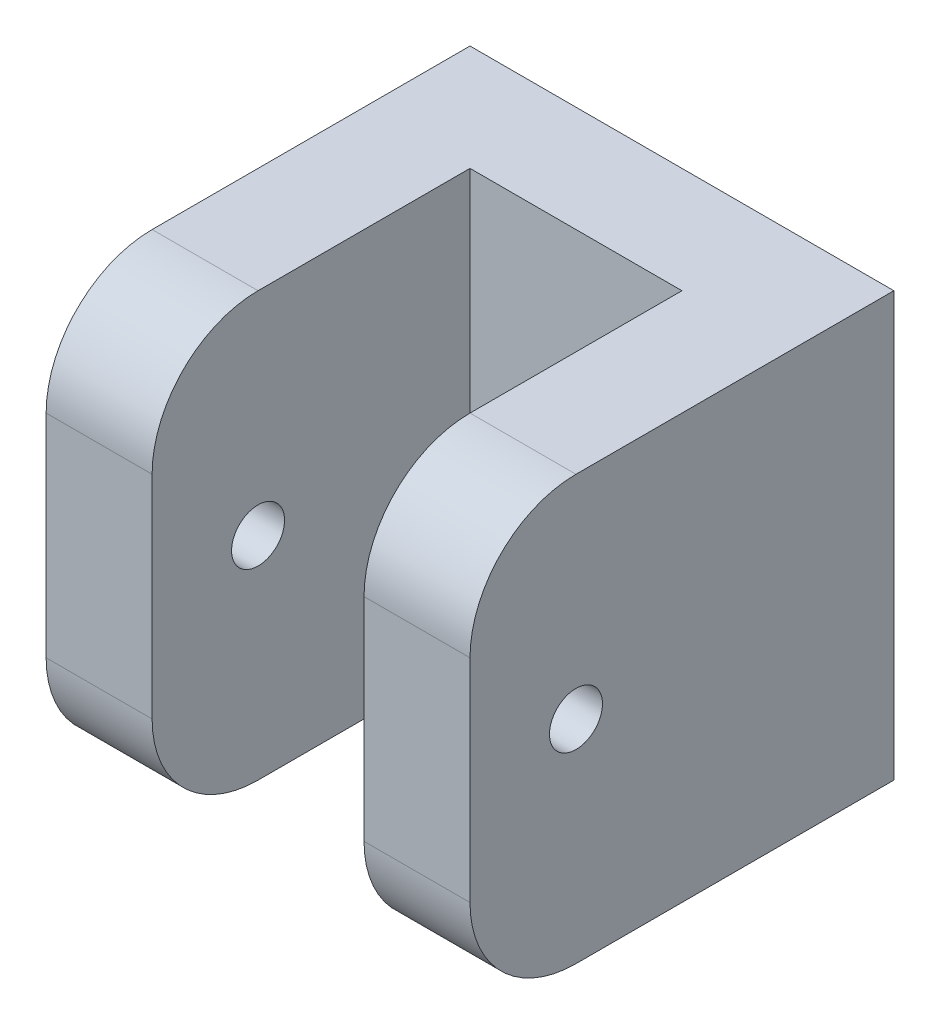
ISO-10303-21;
HEADER;
FILE_DESCRIPTION(('STEP AP214'),'2;1');
FILE_NAME('part.step','',(''),(''),'','','');
FILE_SCHEMA(('AUTOMOTIVE_DESIGN { 1 0 10303 214 1 1 1 1 }'));
ENDSEC;
DATA;
#1=APPLICATION_CONTEXT('core data for automotive mechanical design processes');
#2=APPLICATION_PROTOCOL_DEFINITION('international standard','automotive_design',2000,#1);
#3=PRODUCT_CONTEXT('',#1,'mechanical');
#4=PRODUCT('Part','Part','',(#3));
#5=PRODUCT_RELATED_PRODUCT_CATEGORY('part','',(#4));
#6=PRODUCT_DEFINITION_FORMATION('','',#4);
#7=PRODUCT_DEFINITION_CONTEXT('part definition',#1,'design');
#8=PRODUCT_DEFINITION('design','',#6,#7);
#9=PRODUCT_DEFINITION_SHAPE('','',#8);
#10=(LENGTH_UNIT() NAMED_UNIT(*) SI_UNIT(.MILLI.,.METRE.));
#11=(NAMED_UNIT(*) PLANE_ANGLE_UNIT() SI_UNIT($,.RADIAN.));
#12=(NAMED_UNIT(*) SI_UNIT($,.STERADIAN.) SOLID_ANGLE_UNIT());
#13=UNCERTAINTY_MEASURE_WITH_UNIT(LENGTH_MEASURE(1.E-05),#10,'distance_accuracy_value','');
#14=(GEOMETRIC_REPRESENTATION_CONTEXT(3) GLOBAL_UNCERTAINTY_ASSIGNED_CONTEXT((#13)) GLOBAL_UNIT_ASSIGNED_CONTEXT((#10,
#11,#12)) REPRESENTATION_CONTEXT('',''));
#15=CARTESIAN_POINT('',(0.,0.,0.));
#16=DIRECTION('',(0.,0.,1.));
#17=DIRECTION('',(1.,0.,0.));
#18=AXIS2_PLACEMENT_3D('',#15,#16,#17);
#19=CARTESIAN_POINT('',(25.3999999999999,50.8,25.3999999999999));
#20=DIRECTION('',(0.,0.,-1.));
#21=DIRECTION('',(-1.,0.,0.));
#22=AXIS2_PLACEMENT_3D('',#19,#20,#21);
#23=PLANE('',#22);
#24=DIRECTION('',(0.,-1.,0.));
#25=VECTOR('',#24,1.);
#26=CARTESIAN_POINT('',(-25.4,50.8,25.4));
#27=LINE('',#26,#25);
#28=CARTESIAN_POINT('',(-25.4,38.1,25.4));
#29=VERTEX_POINT('',#28);
#30=CARTESIAN_POINT('',(-25.4,12.7,25.4));
#31=VERTEX_POINT('',#30);
#32=EDGE_CURVE('E190',#29,#31,#27,.T.);
#33=ORIENTED_EDGE('',*,*,#32,.T.);
#34=DIRECTION('',(1.,0.,0.));
#35=VECTOR('',#34,1.);
#36=CARTESIAN_POINT('',(25.3999999999999,12.7,25.3999999999999));
#37=LINE('',#36,#35);
#38=CARTESIAN_POINT('',(-12.7,12.7,25.4));
#39=VERTEX_POINT('',#38);
#40=EDGE_CURVE('E200',#31,#39,#37,.T.);
#41=ORIENTED_EDGE('',*,*,#40,.T.);
#42=DIRECTION('',(0.,1.,0.));
#43=VECTOR('',#42,1.);
#44=CARTESIAN_POINT('',(-12.7,0.,25.4));
#45=LINE('',#44,#43);
#46=CARTESIAN_POINT('',(-12.7,38.1,25.4));
#47=VERTEX_POINT('',#46);
#48=EDGE_CURVE('E153',#39,#47,#45,.T.);
#49=ORIENTED_EDGE('',*,*,#48,.T.);
#50=DIRECTION('',(1.,0.,0.));
#51=VECTOR('',#50,1.);
#52=CARTESIAN_POINT('',(-25.4,38.1,25.4));
#53=LINE('',#52,#51);
#54=EDGE_CURVE('E193',#47,#29,#53,.F.);
#55=ORIENTED_EDGE('',*,*,#54,.T.);
#56=EDGE_LOOP('',(#33,#41,#49,#55));
#57=FACE_BOUND('',#56,.T.);
#58=ADVANCED_FACE('F37',(#57),#23,.F.);
#59=CARTESIAN_POINT('',(-25.4,50.8,25.4));
#60=DIRECTION('',(1.,0.,0.));
#61=DIRECTION('',(0.,0.,-1.));
#62=AXIS2_PLACEMENT_3D('',#59,#60,#61);
#63=PLANE('',#62);
#64=CARTESIAN_POINT('',(-25.4,25.4,12.6999999999999));
#65=DIRECTION('',(1.,0.,0.));
#66=DIRECTION('',(0.,0.,-1.));
#67=AXIS2_PLACEMENT_3D('',#64,#65,#66);
#68=CIRCLE('',#67,3.17499999999997);
#69=CARTESIAN_POINT('',(-25.4,25.4,9.5249999999999));
#70=VERTEX_POINT('',#69);
#71=EDGE_CURVE('E198',#70,#70,#68,.T.);
#72=ORIENTED_EDGE('',*,*,#71,.T.);
#73=EDGE_LOOP('',(#72));
#74=FACE_BOUND('',#73,.T.);
#75=DIRECTION('',(0.,0.,1.));
#76=VECTOR('',#75,1.);
#77=CARTESIAN_POINT('',(-25.4,0.,25.4));
#78=LINE('',#77,#76);
#79=CARTESIAN_POINT('',(-25.4,0.,-25.4));
#80=VERTEX_POINT('',#79);
#81=CARTESIAN_POINT('',(-25.4,0.,12.7));
#82=VERTEX_POINT('',#81);
#83=EDGE_CURVE('E139',#80,#82,#78,.T.);
#84=ORIENTED_EDGE('',*,*,#83,.T.);
#85=CARTESIAN_POINT('',(-25.4,12.7,12.7));
#86=DIRECTION('',(1.,0.,0.));
#87=DIRECTION('',(0.,0.,-1.));
#88=AXIS2_PLACEMENT_3D('',#85,#86,#87);
#89=CIRCLE('',#88,12.7);
#90=EDGE_CURVE('E212',#82,#31,#89,.F.);
#91=ORIENTED_EDGE('',*,*,#90,.T.);
#92=ORIENTED_EDGE('',*,*,#32,.F.);
#93=CARTESIAN_POINT('',(-25.4,38.1,12.7));
#94=DIRECTION('',(1.,0.,0.));
#95=DIRECTION('',(0.,0.,-1.));
#96=AXIS2_PLACEMENT_3D('',#93,#94,#95);
#97=CIRCLE('',#96,12.7);
#98=CARTESIAN_POINT('',(-25.4,50.8,12.7));
#99=VERTEX_POINT('',#98);
#100=EDGE_CURVE('E210',#29,#99,#97,.F.);
#101=ORIENTED_EDGE('',*,*,#100,.T.);
#102=DIRECTION('',(0.,0.,1.));
#103=VECTOR('',#102,1.);
#104=CARTESIAN_POINT('',(-25.4,50.8,25.4));
#105=LINE('',#104,#103);
#106=CARTESIAN_POINT('',(-25.4,50.8,-25.4));
#107=VERTEX_POINT('',#106);
#108=EDGE_CURVE('E168',#107,#99,#105,.T.);
#109=ORIENTED_EDGE('',*,*,#108,.F.);
#110=DIRECTION('',(0.,-1.,0.));
#111=VECTOR('',#110,1.);
#112=CARTESIAN_POINT('',(-25.4,50.8,-25.4));
#113=LINE('',#112,#111);
#114=EDGE_CURVE('E176',#107,#80,#113,.T.);
#115=ORIENTED_EDGE('',*,*,#114,.T.);
#116=EDGE_LOOP('',(#84,#91,#92,#101,#109,#115));
#117=FACE_BOUND('',#116,.T.);
#118=ADVANCED_FACE('F236',(#74,#117),#63,.F.);
#119=DIRECTION('',(0.,1.,0.));
#120=VECTOR('',#119,1.);
#121=CARTESIAN_POINT('',(12.6999999999999,0.,25.4));
#122=LINE('',#121,#120);
#123=CARTESIAN_POINT('',(12.6999999999999,12.7,25.4));
#124=VERTEX_POINT('',#123);
#125=CARTESIAN_POINT('',(12.6999999999999,38.1,25.4));
#126=VERTEX_POINT('',#125);
#127=EDGE_CURVE('E156',#124,#126,#122,.T.);
#128=ORIENTED_EDGE('',*,*,#127,.F.);
#129=DIRECTION('',(1.,0.,0.));
#130=VECTOR('',#129,1.);
#131=CARTESIAN_POINT('',(25.3999999999999,12.7,25.3999999999999));
#132=LINE('',#131,#130);
#133=CARTESIAN_POINT('',(25.3999999999999,12.7,25.3999999999999));
#134=VERTEX_POINT('',#133);
#135=EDGE_CURVE('E216',#124,#134,#132,.T.);
#136=ORIENTED_EDGE('',*,*,#135,.T.);
#137=DIRECTION('',(0.,-1.,0.));
#138=VECTOR('',#137,1.);
#139=CARTESIAN_POINT('',(25.3999999999999,50.8,25.3999999999999));
#140=LINE('',#139,#138);
#141=CARTESIAN_POINT('',(25.3999999999999,38.1,25.3999999999999));
#142=VERTEX_POINT('',#141);
#143=EDGE_CURVE('E187',#142,#134,#140,.T.);
#144=ORIENTED_EDGE('',*,*,#143,.F.);
#145=DIRECTION('',(1.,0.,0.));
#146=VECTOR('',#145,1.);
#147=CARTESIAN_POINT('',(12.6999999999999,38.1,25.3999999999999));
#148=LINE('',#147,#146);
#149=EDGE_CURVE('E214',#142,#126,#148,.F.);
#150=ORIENTED_EDGE('',*,*,#149,.T.);
#151=EDGE_LOOP('',(#128,#136,#144,#150));
#152=FACE_BOUND('',#151,.T.);
#153=ADVANCED_FACE('F257',(#152),#23,.F.);
#154=CARTESIAN_POINT('',(25.3999999999999,50.8,25.3999999999999));
#155=DIRECTION('',(-1.,0.,0.));
#156=DIRECTION('',(0.,0.,1.));
#157=AXIS2_PLACEMENT_3D('',#154,#155,#156);
#158=PLANE('',#157);
#159=CARTESIAN_POINT('',(25.3999999999999,25.4,12.6999999999999));
#160=DIRECTION('',(1.,0.,0.));
#161=DIRECTION('',(0.,0.,-1.));
#162=AXIS2_PLACEMENT_3D('',#159,#160,#161);
#163=CIRCLE('',#162,3.17499999999997);
#164=CARTESIAN_POINT('',(25.3999999999999,25.4,9.5249999999999));
#165=VERTEX_POINT('',#164);
#166=EDGE_CURVE('E417',#165,#165,#163,.T.);
#167=ORIENTED_EDGE('',*,*,#166,.F.);
#168=EDGE_LOOP('',(#167));
#169=FACE_BOUND('',#168,.T.);
#170=ORIENTED_EDGE('',*,*,#143,.T.);
#171=CARTESIAN_POINT('',(25.3999999999999,12.7,12.6999999999999));
#172=DIRECTION('',(-1.,0.,0.));
#173=DIRECTION('',(0.,0.,1.));
#174=AXIS2_PLACEMENT_3D('',#171,#172,#173);
#175=CIRCLE('',#174,12.7);
#176=CARTESIAN_POINT('',(25.3999999999999,0.,12.6999999999999));
#177=VERTEX_POINT('',#176);
#178=EDGE_CURVE('E220',#134,#177,#175,.F.);
#179=ORIENTED_EDGE('',*,*,#178,.T.);
#180=DIRECTION('',(0.,0.,-1.));
#181=VECTOR('',#180,1.);
#182=CARTESIAN_POINT('',(25.3999999999999,0.,25.3999999999999));
#183=LINE('',#182,#181);
#184=CARTESIAN_POINT('',(25.3999999999999,0.,-25.4));
#185=VERTEX_POINT('',#184);
#186=EDGE_CURVE('E179',#177,#185,#183,.T.);
#187=ORIENTED_EDGE('',*,*,#186,.T.);
#188=DIRECTION('',(0.,-1.,0.));
#189=VECTOR('',#188,1.);
#190=CARTESIAN_POINT('',(25.3999999999999,50.8,-25.4));
#191=LINE('',#190,#189);
#192=CARTESIAN_POINT('',(25.3999999999999,50.8,-25.4));
#193=VERTEX_POINT('',#192);
#194=EDGE_CURVE('E184',#193,#185,#191,.T.);
#195=ORIENTED_EDGE('',*,*,#194,.F.);
#196=DIRECTION('',(0.,0.,-1.));
#197=VECTOR('',#196,1.);
#198=CARTESIAN_POINT('',(25.3999999999999,50.8,25.3999999999999));
#199=LINE('',#198,#197);
#200=CARTESIAN_POINT('',(25.3999999999999,50.8,12.6999999999999));
#201=VERTEX_POINT('',#200);
#202=EDGE_CURVE('E171',#201,#193,#199,.T.);
#203=ORIENTED_EDGE('',*,*,#202,.F.);
#204=CARTESIAN_POINT('',(25.3999999999999,38.1,12.6999999999999));
#205=DIRECTION('',(-1.,0.,0.));
#206=DIRECTION('',(0.,0.,1.));
#207=AXIS2_PLACEMENT_3D('',#204,#205,#206);
#208=CIRCLE('',#207,12.7);
#209=EDGE_CURVE('E60',#201,#142,#208,.F.);
#210=ORIENTED_EDGE('',*,*,#209,.T.);
#211=EDGE_LOOP('',(#170,#179,#187,#195,#203,#210));
#212=FACE_BOUND('',#211,.T.);
#213=ADVANCED_FACE('F261',(#169,#212),#158,.F.);
#214=CARTESIAN_POINT('',(25.3999999999999,50.8,-25.4));
#215=DIRECTION('',(0.,0.,1.));
#216=DIRECTION('',(1.,0.,0.));
#217=AXIS2_PLACEMENT_3D('',#214,#215,#216);
#218=PLANE('',#217);
#219=CARTESIAN_POINT('',(0.,25.4,-25.4));
#220=DIRECTION('',(0.,0.,1.));
#221=DIRECTION('',(1.,0.,0.));
#222=AXIS2_PLACEMENT_3D('',#219,#220,#221);
#223=CIRCLE('',#222,3.175);
#224=CARTESIAN_POINT('',(3.17500000000006,25.4,-25.4));
#225=VERTEX_POINT('',#224);
#226=EDGE_CURVE('E163',#225,#225,#223,.T.);
#227=ORIENTED_EDGE('',*,*,#226,.T.);
#228=EDGE_LOOP('',(#227));
#229=FACE_BOUND('',#228,.T.);
#230=DIRECTION('',(-1.,0.,0.));
#231=VECTOR('',#230,1.);
#232=CARTESIAN_POINT('',(25.3999999999999,0.,-25.4));
#233=LINE('',#232,#231);
#234=EDGE_CURVE('E172',#185,#80,#233,.T.);
#235=ORIENTED_EDGE('',*,*,#234,.T.);
#236=ORIENTED_EDGE('',*,*,#114,.F.);
#237=DIRECTION('',(-1.,0.,0.));
#238=VECTOR('',#237,1.);
#239=CARTESIAN_POINT('',(25.3999999999999,50.8,-25.4));
#240=LINE('',#239,#238);
#241=EDGE_CURVE('E174',#193,#107,#240,.T.);
#242=ORIENTED_EDGE('',*,*,#241,.F.);
#243=ORIENTED_EDGE('',*,*,#194,.T.);
#244=EDGE_LOOP('',(#235,#236,#242,#243));
#245=FACE_BOUND('',#244,.T.);
#246=ADVANCED_FACE('F245',(#229,#245),#218,.F.);
#247=CARTESIAN_POINT('',(0.,50.8,0.));
#248=DIRECTION('',(0.,1.,0.));
#249=DIRECTION('',(0.,0.,1.));
#250=AXIS2_PLACEMENT_3D('',#247,#248,#249);
#251=PLANE('',#250);
#252=DIRECTION('',(0.,0.,-1.));
#253=VECTOR('',#252,1.);
#254=CARTESIAN_POINT('',(12.6999999999999,50.8,25.4));
#255=LINE('',#254,#253);
#256=CARTESIAN_POINT('',(12.6999999999999,50.8,12.6999999999999));
#257=VERTEX_POINT('',#256);
#258=CARTESIAN_POINT('',(12.6999999999999,50.8,-12.6999999999999));
#259=VERTEX_POINT('',#258);
#260=EDGE_CURVE('E162',#257,#259,#255,.T.);
#261=ORIENTED_EDGE('',*,*,#260,.F.);
#262=DIRECTION('',(1.,0.,0.));
#263=VECTOR('',#262,1.);
#264=CARTESIAN_POINT('',(25.3999999999999,50.8,12.6999999999999));
#265=LINE('',#264,#263);
#266=EDGE_CURVE('E11',#257,#201,#265,.T.);
#267=ORIENTED_EDGE('',*,*,#266,.T.);
#268=ORIENTED_EDGE('',*,*,#202,.T.);
#269=ORIENTED_EDGE('',*,*,#241,.T.);
#270=ORIENTED_EDGE('',*,*,#108,.T.);
#271=DIRECTION('',(1.,0.,0.));
#272=VECTOR('',#271,1.);
#273=CARTESIAN_POINT('',(-12.7000000000001,50.8,12.6999999999999));
#274=LINE('',#273,#272);
#275=CARTESIAN_POINT('',(-12.7,50.8,12.6999999999999));
#276=VERTEX_POINT('',#275);
#277=EDGE_CURVE('E45',#99,#276,#274,.T.);
#278=ORIENTED_EDGE('',*,*,#277,.T.);
#279=DIRECTION('',(0.,0.,1.));
#280=VECTOR('',#279,1.);
#281=CARTESIAN_POINT('',(-12.7,50.8,25.4));
#282=LINE('',#281,#280);
#283=CARTESIAN_POINT('',(-12.7,50.8,-12.7));
#284=VERTEX_POINT('',#283);
#285=EDGE_CURVE('E160',#284,#276,#282,.T.);
#286=ORIENTED_EDGE('',*,*,#285,.F.);
#287=DIRECTION('',(-1.,0.,0.));
#288=VECTOR('',#287,1.);
#289=CARTESIAN_POINT('',(-12.7,50.8,-12.7));
#290=LINE('',#289,#288);
#291=EDGE_CURVE('E135',#259,#284,#290,.T.);
#292=ORIENTED_EDGE('',*,*,#291,.F.);
#293=EDGE_LOOP('',(#261,#267,#268,#269,#270,#278,#286,#292));
#294=FACE_BOUND('',#293,.T.);
#295=ADVANCED_FACE('F227',(#294),#251,.T.);
#296=CARTESIAN_POINT('',(0.,0.,0.));
#297=DIRECTION('',(0.,1.,0.));
#298=DIRECTION('',(0.,0.,1.));
#299=AXIS2_PLACEMENT_3D('',#296,#297,#298);
#300=PLANE('',#299);
#301=DIRECTION('',(0.,0.,1.));
#302=VECTOR('',#301,1.);
#303=CARTESIAN_POINT('',(-12.7,0.,25.4));
#304=LINE('',#303,#302);
#305=CARTESIAN_POINT('',(-12.7,0.,-12.7));
#306=VERTEX_POINT('',#305);
#307=CARTESIAN_POINT('',(-12.7,0.,12.6999999999999));
#308=VERTEX_POINT('',#307);
#309=EDGE_CURVE('E143',#306,#308,#304,.T.);
#310=ORIENTED_EDGE('',*,*,#309,.T.);
#311=DIRECTION('',(1.,0.,0.));
#312=VECTOR('',#311,1.);
#313=CARTESIAN_POINT('',(0.,0.,12.6999999999999));
#314=LINE('',#313,#312);
#315=EDGE_CURVE('E208',#308,#82,#314,.F.);
#316=ORIENTED_EDGE('',*,*,#315,.T.);
#317=ORIENTED_EDGE('',*,*,#83,.F.);
#318=ORIENTED_EDGE('',*,*,#234,.F.);
#319=ORIENTED_EDGE('',*,*,#186,.F.);
#320=DIRECTION('',(1.,0.,0.));
#321=VECTOR('',#320,1.);
#322=CARTESIAN_POINT('',(0.,0.,12.6999999999999));
#323=LINE('',#322,#321);
#324=CARTESIAN_POINT('',(12.6999999999999,0.,12.6999999999999));
#325=VERTEX_POINT('',#324);
#326=EDGE_CURVE('E206',#177,#325,#323,.F.);
#327=ORIENTED_EDGE('',*,*,#326,.T.);
#328=DIRECTION('',(0.,0.,-1.));
#329=VECTOR('',#328,1.);
#330=CARTESIAN_POINT('',(12.6999999999999,0.,25.4));
#331=LINE('',#330,#329);
#332=CARTESIAN_POINT('',(12.6999999999999,0.,-12.6999999999999));
#333=VERTEX_POINT('',#332);
#334=EDGE_CURVE('E149',#325,#333,#331,.T.);
#335=ORIENTED_EDGE('',*,*,#334,.T.);
#336=DIRECTION('',(-1.,0.,0.));
#337=VECTOR('',#336,1.);
#338=CARTESIAN_POINT('',(-12.7,0.,-12.7));
#339=LINE('',#338,#337);
#340=EDGE_CURVE('E132',#333,#306,#339,.T.);
#341=ORIENTED_EDGE('',*,*,#340,.T.);
#342=EDGE_LOOP('',(#310,#316,#317,#318,#319,#327,#335,#341));
#343=FACE_BOUND('',#342,.T.);
#344=ADVANCED_FACE('F151',(#343),#300,.F.);
#345=CARTESIAN_POINT('',(-12.7,0.,25.4));
#346=DIRECTION('',(-1.,0.,0.));
#347=DIRECTION('',(0.,0.,1.));
#348=AXIS2_PLACEMENT_3D('',#345,#346,#347);
#349=PLANE('',#348);
#350=CARTESIAN_POINT('',(-12.7,25.4,12.6999999999999));
#351=DIRECTION('',(-1.,0.,0.));
#352=DIRECTION('',(0.,0.,1.));
#353=AXIS2_PLACEMENT_3D('',#350,#351,#352);
#354=CIRCLE('',#353,3.17499999999997);
#355=CARTESIAN_POINT('',(-12.7,25.4,15.8749999999999));
#356=VERTEX_POINT('',#355);
#357=EDGE_CURVE('E197',#356,#356,#354,.T.);
#358=ORIENTED_EDGE('',*,*,#357,.T.);
#359=EDGE_LOOP('',(#358));
#360=FACE_BOUND('',#359,.T.);
#361=ORIENTED_EDGE('',*,*,#48,.F.);
#362=CARTESIAN_POINT('',(-12.7,12.7,12.6999999999999));
#363=DIRECTION('',(-1.,0.,0.));
#364=DIRECTION('',(0.,0.,1.));
#365=AXIS2_PLACEMENT_3D('',#362,#363,#364);
#366=CIRCLE('',#365,12.7);
#367=EDGE_CURVE('E146',#39,#308,#366,.F.);
#368=ORIENTED_EDGE('',*,*,#367,.T.);
#369=ORIENTED_EDGE('',*,*,#309,.F.);
#370=DIRECTION('',(0.,1.,0.));
#371=VECTOR('',#370,1.);
#372=CARTESIAN_POINT('',(-12.7,0.,-12.7));
#373=LINE('',#372,#371);
#374=EDGE_CURVE('E127',#306,#284,#373,.T.);
#375=ORIENTED_EDGE('',*,*,#374,.T.);
#376=ORIENTED_EDGE('',*,*,#285,.T.);
#377=CARTESIAN_POINT('',(-12.7,38.1,12.6999999999999));
#378=DIRECTION('',(-1.,0.,0.));
#379=DIRECTION('',(0.,0.,1.));
#380=AXIS2_PLACEMENT_3D('',#377,#378,#379);
#381=CIRCLE('',#380,12.7);
#382=EDGE_CURVE('E203',#276,#47,#381,.F.);
#383=ORIENTED_EDGE('',*,*,#382,.T.);
#384=EDGE_LOOP('',(#361,#368,#369,#375,#376,#383));
#385=FACE_BOUND('',#384,.T.);
#386=ADVANCED_FACE('F145',(#360,#385),#349,.F.);
#387=CARTESIAN_POINT('',(-12.7,0.,-12.7));
#388=DIRECTION('',(0.,0.,-1.));
#389=DIRECTION('',(-1.,0.,0.));
#390=AXIS2_PLACEMENT_3D('',#387,#388,#389);
#391=PLANE('',#390);
#392=CARTESIAN_POINT('',(0.,25.4,-12.6999999999999));
#393=DIRECTION('',(0.,0.,1.));
#394=DIRECTION('',(1.,0.,0.));
#395=AXIS2_PLACEMENT_3D('',#392,#393,#394);
#396=CIRCLE('',#395,3.175);
#397=CARTESIAN_POINT('',(3.17500000000006,25.4,-12.6999999999999));
#398=VERTEX_POINT('',#397);
#399=EDGE_CURVE('E409',#398,#398,#396,.T.);
#400=ORIENTED_EDGE('',*,*,#399,.F.);
#401=EDGE_LOOP('',(#400));
#402=FACE_BOUND('',#401,.T.);
#403=ORIENTED_EDGE('',*,*,#291,.T.);
#404=ORIENTED_EDGE('',*,*,#374,.F.);
#405=ORIENTED_EDGE('',*,*,#340,.F.);
#406=DIRECTION('',(0.,1.,0.));
#407=VECTOR('',#406,1.);
#408=CARTESIAN_POINT('',(12.6999999999999,0.,-12.6999999999999));
#409=LINE('',#408,#407);
#410=EDGE_CURVE('E140',#333,#259,#409,.T.);
#411=ORIENTED_EDGE('',*,*,#410,.T.);
#412=EDGE_LOOP('',(#403,#404,#405,#411));
#413=FACE_BOUND('',#412,.T.);
#414=ADVANCED_FACE('F129',(#402,#413),#391,.F.);
#415=CARTESIAN_POINT('',(12.6999999999999,0.,25.4));
#416=DIRECTION('',(1.,0.,0.));
#417=DIRECTION('',(0.,0.,-1.));
#418=AXIS2_PLACEMENT_3D('',#415,#416,#417);
#419=PLANE('',#418);
#420=CARTESIAN_POINT('',(12.6999999999999,25.4,12.6999999999999));
#421=DIRECTION('',(1.,0.,0.));
#422=DIRECTION('',(0.,0.,-1.));
#423=AXIS2_PLACEMENT_3D('',#420,#421,#422);
#424=CIRCLE('',#423,3.17499999999997);
#425=CARTESIAN_POINT('',(12.6999999999999,25.4,9.5249999999999));
#426=VERTEX_POINT('',#425);
#427=EDGE_CURVE('E194',#426,#426,#424,.T.);
#428=ORIENTED_EDGE('',*,*,#427,.T.);
#429=EDGE_LOOP('',(#428));
#430=FACE_BOUND('',#429,.T.);
#431=ORIENTED_EDGE('',*,*,#334,.F.);
#432=CARTESIAN_POINT('',(12.6999999999999,12.7,12.6999999999999));
#433=DIRECTION('',(1.,0.,0.));
#434=DIRECTION('',(0.,0.,-1.));
#435=AXIS2_PLACEMENT_3D('',#432,#433,#434);
#436=CIRCLE('',#435,12.7);
#437=EDGE_CURVE('E223',#325,#124,#436,.F.);
#438=ORIENTED_EDGE('',*,*,#437,.T.);
#439=ORIENTED_EDGE('',*,*,#127,.T.);
#440=CARTESIAN_POINT('',(12.6999999999999,38.1,12.6999999999999));
#441=DIRECTION('',(1.,0.,0.));
#442=DIRECTION('',(0.,0.,-1.));
#443=AXIS2_PLACEMENT_3D('',#440,#441,#442);
#444=CIRCLE('',#443,12.7);
#445=EDGE_CURVE('E52',#126,#257,#444,.F.);
#446=ORIENTED_EDGE('',*,*,#445,.T.);
#447=ORIENTED_EDGE('',*,*,#260,.T.);
#448=ORIENTED_EDGE('',*,*,#410,.F.);
#449=EDGE_LOOP('',(#431,#438,#439,#446,#447,#448));
#450=FACE_BOUND('',#449,.T.);
#451=ADVANCED_FACE('F255',(#430,#450),#419,.F.);
#452=CARTESIAN_POINT('',(0.,25.4,-25.4));
#453=DIRECTION('',(0.,0.,1.));
#454=DIRECTION('',(1.,0.,0.));
#455=AXIS2_PLACEMENT_3D('',#452,#453,#454);
#456=CYLINDRICAL_SURFACE('',#455,3.175);
#457=ORIENTED_EDGE('',*,*,#226,.F.);
#458=EDGE_LOOP('',(#457));
#459=FACE_BOUND('',#458,.T.);
#460=ORIENTED_EDGE('',*,*,#399,.T.);
#461=EDGE_LOOP('',(#460));
#462=FACE_BOUND('',#461,.T.);
#463=ADVANCED_FACE('F317',(#459,#462),#456,.F.);
#464=CARTESIAN_POINT('',(-25.4,25.4,12.6999999999999));
#465=DIRECTION('',(1.,0.,0.));
#466=DIRECTION('',(0.,0.,-1.));
#467=AXIS2_PLACEMENT_3D('',#464,#465,#466);
#468=CYLINDRICAL_SURFACE('',#467,3.17499999999997);
#469=ORIENTED_EDGE('',*,*,#166,.T.);
#470=EDGE_LOOP('',(#469));
#471=FACE_BOUND('',#470,.T.);
#472=ORIENTED_EDGE('',*,*,#427,.F.);
#473=EDGE_LOOP('',(#472));
#474=FACE_BOUND('',#473,.T.);
#475=ADVANCED_FACE('F375',(#471,#474),#468,.F.);
#476=ORIENTED_EDGE('',*,*,#71,.F.);
#477=EDGE_LOOP('',(#476));
#478=FACE_BOUND('',#477,.T.);
#479=ORIENTED_EDGE('',*,*,#357,.F.);
#480=EDGE_LOOP('',(#479));
#481=FACE_BOUND('',#480,.T.);
#482=ADVANCED_FACE('F282',(#478,#481),#468,.F.);
#483=CARTESIAN_POINT('',(25.3999999999999,12.7,12.6999999999999));
#484=DIRECTION('',(1.,0.,0.));
#485=DIRECTION('',(0.,0.,-1.));
#486=AXIS2_PLACEMENT_3D('',#483,#484,#485);
#487=CYLINDRICAL_SURFACE('',#486,12.7);
#488=ORIENTED_EDGE('',*,*,#90,.F.);
#489=ORIENTED_EDGE('',*,*,#315,.F.);
#490=ORIENTED_EDGE('',*,*,#367,.F.);
#491=ORIENTED_EDGE('',*,*,#40,.F.);
#492=EDGE_LOOP('',(#488,#489,#490,#491));
#493=FACE_BOUND('',#492,.T.);
#494=ADVANCED_FACE('F239',(#493),#487,.T.);
#495=CARTESIAN_POINT('',(25.3999999999999,12.7,12.6999999999999));
#496=DIRECTION('',(1.,0.,0.));
#497=DIRECTION('',(0.,0.,-1.));
#498=AXIS2_PLACEMENT_3D('',#495,#496,#497);
#499=CYLINDRICAL_SURFACE('',#498,12.7);
#500=ORIENTED_EDGE('',*,*,#437,.F.);
#501=ORIENTED_EDGE('',*,*,#326,.F.);
#502=ORIENTED_EDGE('',*,*,#178,.F.);
#503=ORIENTED_EDGE('',*,*,#135,.F.);
#504=EDGE_LOOP('',(#500,#501,#502,#503));
#505=FACE_BOUND('',#504,.T.);
#506=ADVANCED_FACE('F252',(#505),#499,.T.);
#507=CARTESIAN_POINT('',(0.,38.1,12.6999999999999));
#508=DIRECTION('',(-1.,0.,0.));
#509=DIRECTION('',(0.,0.,1.));
#510=AXIS2_PLACEMENT_3D('',#507,#508,#509);
#511=CYLINDRICAL_SURFACE('',#510,12.7);
#512=ORIENTED_EDGE('',*,*,#445,.F.);
#513=ORIENTED_EDGE('',*,*,#149,.F.);
#514=ORIENTED_EDGE('',*,*,#209,.F.);
#515=ORIENTED_EDGE('',*,*,#266,.F.);
#516=EDGE_LOOP('',(#512,#513,#514,#515));
#517=FACE_BOUND('',#516,.T.);
#518=ADVANCED_FACE('F259',(#517),#511,.T.);
#519=CARTESIAN_POINT('',(0.,38.1,12.6999999999999));
#520=DIRECTION('',(-1.,0.,0.));
#521=DIRECTION('',(0.,0.,1.));
#522=AXIS2_PLACEMENT_3D('',#519,#520,#521);
#523=CYLINDRICAL_SURFACE('',#522,12.7);
#524=ORIENTED_EDGE('',*,*,#100,.F.);
#525=ORIENTED_EDGE('',*,*,#54,.F.);
#526=ORIENTED_EDGE('',*,*,#382,.F.);
#527=ORIENTED_EDGE('',*,*,#277,.F.);
#528=EDGE_LOOP('',(#524,#525,#526,#527));
#529=FACE_BOUND('',#528,.T.);
#530=ADVANCED_FACE('F39',(#529),#523,.T.);
#531=CLOSED_SHELL('',(#58,#118,#153,#213,#246,#295,#344,#386,#414,#451,#463,#475,#482,#494,#506,
#518,#530));
#532=MANIFOLD_SOLID_BREP('B2',#531);
#533=ADVANCED_BREP_SHAPE_REPRESENTATION('',(#18,#532),#14);
#534=SHAPE_DEFINITION_REPRESENTATION(#9,#533);
ENDSEC;
END-ISO-10303-21;
